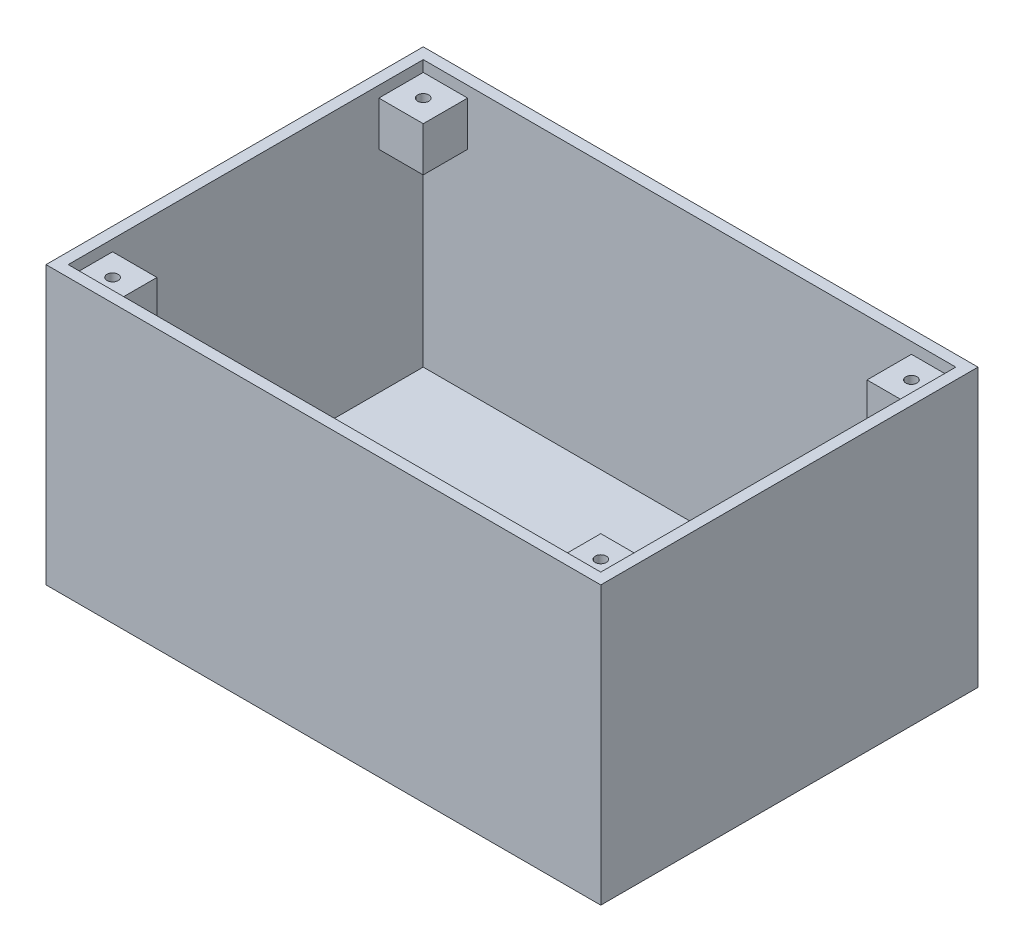
ISO-10303-21;
HEADER;
FILE_DESCRIPTION(('STEP AP214'),'2;1');
FILE_NAME('part.step','',(''),(''),'','','');
FILE_SCHEMA(('AUTOMOTIVE_DESIGN { 1 0 10303 214 1 1 1 1 }'));
ENDSEC;
DATA;
#1=APPLICATION_CONTEXT('core data for automotive mechanical design processes');
#2=APPLICATION_PROTOCOL_DEFINITION('international standard','automotive_design',2000,#1);
#3=PRODUCT_CONTEXT('',#1,'mechanical');
#4=PRODUCT('Part','Part','',(#3));
#5=PRODUCT_RELATED_PRODUCT_CATEGORY('part','',(#4));
#6=PRODUCT_DEFINITION_FORMATION('','',#4);
#7=PRODUCT_DEFINITION_CONTEXT('part definition',#1,'design');
#8=PRODUCT_DEFINITION('design','',#6,#7);
#9=PRODUCT_DEFINITION_SHAPE('','',#8);
#10=(LENGTH_UNIT() NAMED_UNIT(*) SI_UNIT(.MILLI.,.METRE.));
#11=(NAMED_UNIT(*) PLANE_ANGLE_UNIT() SI_UNIT($,.RADIAN.));
#12=(NAMED_UNIT(*) SI_UNIT($,.STERADIAN.) SOLID_ANGLE_UNIT());
#13=UNCERTAINTY_MEASURE_WITH_UNIT(LENGTH_MEASURE(1.E-05),#10,'distance_accuracy_value','');
#14=(GEOMETRIC_REPRESENTATION_CONTEXT(3) GLOBAL_UNCERTAINTY_ASSIGNED_CONTEXT((#13)) GLOBAL_UNIT_ASSIGNED_CONTEXT((#10,
#11,#12)) REPRESENTATION_CONTEXT('',''));
#15=CARTESIAN_POINT('',(0.,0.,0.));
#16=DIRECTION('',(0.,0.,1.));
#17=DIRECTION('',(1.,0.,0.));
#18=AXIS2_PLACEMENT_3D('',#15,#16,#17);
#19=CARTESIAN_POINT('',(-152.4,152.4,76.2));
#20=DIRECTION('',(1.,0.,0.));
#21=DIRECTION('',(0.,0.,-1.));
#22=AXIS2_PLACEMENT_3D('',#19,#20,#21);
#23=PLANE('',#22);
#24=DIRECTION('',(0.,1.,0.));
#25=VECTOR('',#24,1.);
#26=CARTESIAN_POINT('',(-152.4,152.4,101.6));
#27=LINE('',#26,#25);
#28=CARTESIAN_POINT('',(-152.4,127.,101.6));
#29=VERTEX_POINT('',#28);
#30=CARTESIAN_POINT('',(-152.4,152.4,101.6));
#31=VERTEX_POINT('',#30);
#32=EDGE_CURVE('E111',#29,#31,#27,.T.);
#33=ORIENTED_EDGE('',*,*,#32,.T.);
#34=DIRECTION('',(0.,0.,1.));
#35=VECTOR('',#34,1.);
#36=CARTESIAN_POINT('',(-152.4,152.4,76.2));
#37=LINE('',#36,#35);
#38=CARTESIAN_POINT('',(-152.4,152.4,76.2));
#39=VERTEX_POINT('',#38);
#40=EDGE_CURVE('E12',#39,#31,#37,.T.);
#41=ORIENTED_EDGE('',*,*,#40,.F.);
#42=DIRECTION('',(0.,1.,0.));
#43=VECTOR('',#42,1.);
#44=CARTESIAN_POINT('',(-152.4,152.4,76.2));
#45=LINE('',#44,#43);
#46=CARTESIAN_POINT('',(-152.4,127.,76.2));
#47=VERTEX_POINT('',#46);
#48=EDGE_CURVE('E99',#47,#39,#45,.T.);
#49=ORIENTED_EDGE('',*,*,#48,.F.);
#50=DIRECTION('',(0.,0.,1.));
#51=VECTOR('',#50,1.);
#52=CARTESIAN_POINT('',(-152.4,127.,76.2));
#53=LINE('',#52,#51);
#54=EDGE_CURVE('E107',#47,#29,#53,.T.);
#55=ORIENTED_EDGE('',*,*,#54,.T.);
#56=EDGE_LOOP('',(#33,#41,#49,#55));
#57=FACE_BOUND('',#56,.T.);
#58=ADVANCED_FACE('F48',(#57),#23,.F.);
#59=CARTESIAN_POINT('',(-152.4,152.4,76.2));
#60=DIRECTION('',(0.,-1.,0.));
#61=DIRECTION('',(0.,0.,-1.));
#62=AXIS2_PLACEMENT_3D('',#59,#60,#61);
#63=PLANE('',#62);
#64=CARTESIAN_POINT('',(-139.7,152.4,88.9));
#65=DIRECTION('',(0.,1.,0.));
#66=DIRECTION('',(0.,0.,-1.));
#67=AXIS2_PLACEMENT_3D('',#64,#65,#66);
#68=CIRCLE('',#67,3.175);
#69=CARTESIAN_POINT('',(-139.7,152.4,85.725));
#70=VERTEX_POINT('',#69);
#71=EDGE_CURVE('E125',#70,#70,#68,.T.);
#72=ORIENTED_EDGE('',*,*,#71,.F.);
#73=EDGE_LOOP('',(#72));
#74=FACE_BOUND('',#73,.T.);
#75=DIRECTION('',(1.,0.,0.));
#76=VECTOR('',#75,1.);
#77=CARTESIAN_POINT('',(-152.4,152.4,101.6));
#78=LINE('',#77,#76);
#79=CARTESIAN_POINT('',(-127.,152.4,101.6));
#80=VERTEX_POINT('',#79);
#81=EDGE_CURVE('E103',#31,#80,#78,.T.);
#82=ORIENTED_EDGE('',*,*,#81,.T.);
#83=DIRECTION('',(0.,0.,1.));
#84=VECTOR('',#83,1.);
#85=CARTESIAN_POINT('',(-127.,152.4,76.2));
#86=LINE('',#85,#84);
#87=CARTESIAN_POINT('',(-127.,152.4,76.2));
#88=VERTEX_POINT('',#87);
#89=EDGE_CURVE('E56',#88,#80,#86,.T.);
#90=ORIENTED_EDGE('',*,*,#89,.F.);
#91=DIRECTION('',(1.,0.,0.));
#92=VECTOR('',#91,1.);
#93=CARTESIAN_POINT('',(-152.4,152.4,76.2));
#94=LINE('',#93,#92);
#95=EDGE_CURVE('E94',#39,#88,#94,.T.);
#96=ORIENTED_EDGE('',*,*,#95,.F.);
#97=ORIENTED_EDGE('',*,*,#40,.T.);
#98=EDGE_LOOP('',(#82,#90,#96,#97));
#99=FACE_BOUND('',#98,.T.);
#100=ADVANCED_FACE('F102',(#74,#99),#63,.F.);
#101=CARTESIAN_POINT('',(-127.,152.4,76.2));
#102=DIRECTION('',(-1.,0.,0.));
#103=DIRECTION('',(0.,0.,1.));
#104=AXIS2_PLACEMENT_3D('',#101,#102,#103);
#105=PLANE('',#104);
#106=DIRECTION('',(0.,-1.,0.));
#107=VECTOR('',#106,1.);
#108=CARTESIAN_POINT('',(-127.,152.4,101.6));
#109=LINE('',#108,#107);
#110=CARTESIAN_POINT('',(-127.,127.,101.6));
#111=VERTEX_POINT('',#110);
#112=EDGE_CURVE('E81',#80,#111,#109,.T.);
#113=ORIENTED_EDGE('',*,*,#112,.T.);
#114=DIRECTION('',(0.,0.,1.));
#115=VECTOR('',#114,1.);
#116=CARTESIAN_POINT('',(-127.,127.,76.2));
#117=LINE('',#116,#115);
#118=CARTESIAN_POINT('',(-127.,127.,76.2));
#119=VERTEX_POINT('',#118);
#120=EDGE_CURVE('E104',#119,#111,#117,.T.);
#121=ORIENTED_EDGE('',*,*,#120,.F.);
#122=DIRECTION('',(0.,-1.,0.));
#123=VECTOR('',#122,1.);
#124=CARTESIAN_POINT('',(-127.,152.4,76.2));
#125=LINE('',#124,#123);
#126=EDGE_CURVE('E97',#88,#119,#125,.T.);
#127=ORIENTED_EDGE('',*,*,#126,.F.);
#128=ORIENTED_EDGE('',*,*,#89,.T.);
#129=EDGE_LOOP('',(#113,#121,#127,#128));
#130=FACE_BOUND('',#129,.T.);
#131=ADVANCED_FACE('F105',(#130),#105,.F.);
#132=CARTESIAN_POINT('',(-152.4,127.,76.2));
#133=DIRECTION('',(0.,1.,0.));
#134=DIRECTION('',(0.,0.,1.));
#135=AXIS2_PLACEMENT_3D('',#132,#133,#134);
#136=PLANE('',#135);
#137=DIRECTION('',(-1.,0.,0.));
#138=VECTOR('',#137,1.);
#139=CARTESIAN_POINT('',(-152.4,127.,101.6));
#140=LINE('',#139,#138);
#141=EDGE_CURVE('E87',#111,#29,#140,.T.);
#142=ORIENTED_EDGE('',*,*,#141,.T.);
#143=ORIENTED_EDGE('',*,*,#54,.F.);
#144=DIRECTION('',(-1.,0.,0.));
#145=VECTOR('',#144,1.);
#146=CARTESIAN_POINT('',(-152.4,127.,76.2));
#147=LINE('',#146,#145);
#148=EDGE_CURVE('E64',#119,#47,#147,.T.);
#149=ORIENTED_EDGE('',*,*,#148,.F.);
#150=ORIENTED_EDGE('',*,*,#120,.T.);
#151=EDGE_LOOP('',(#142,#143,#149,#150));
#152=FACE_BOUND('',#151,.T.);
#153=ADVANCED_FACE('F119',(#152),#136,.F.);
#154=CARTESIAN_POINT('',(0.,0.,76.2));
#155=DIRECTION('',(0.,0.,1.));
#156=DIRECTION('',(1.,0.,0.));
#157=AXIS2_PLACEMENT_3D('',#154,#155,#156);
#158=PLANE('',#157);
#159=ORIENTED_EDGE('',*,*,#48,.T.);
#160=ORIENTED_EDGE('',*,*,#95,.T.);
#161=ORIENTED_EDGE('',*,*,#126,.T.);
#162=ORIENTED_EDGE('',*,*,#148,.T.);
#163=EDGE_LOOP('',(#159,#160,#161,#162));
#164=FACE_BOUND('',#163,.T.);
#165=ADVANCED_FACE('F95',(#164),#158,.F.);
#166=CARTESIAN_POINT('',(0.,0.,101.6));
#167=DIRECTION('',(0.,0.,1.));
#168=DIRECTION('',(1.,0.,0.));
#169=AXIS2_PLACEMENT_3D('',#166,#167,#168);
#170=PLANE('',#169);
#171=ORIENTED_EDGE('',*,*,#32,.F.);
#172=ORIENTED_EDGE('',*,*,#141,.F.);
#173=ORIENTED_EDGE('',*,*,#112,.F.);
#174=ORIENTED_EDGE('',*,*,#81,.F.);
#175=EDGE_LOOP('',(#171,#172,#173,#174));
#176=FACE_BOUND('',#175,.T.);
#177=ADVANCED_FACE('F122',(#176),#170,.T.);
#178=CARTESIAN_POINT('',(-139.7,137.16,88.9));
#179=DIRECTION('',(0.,1.,0.));
#180=DIRECTION('',(0.,0.,1.));
#181=AXIS2_PLACEMENT_3D('',#178,#179,#180);
#182=CYLINDRICAL_SURFACE('',#181,3.175);
#183=CARTESIAN_POINT('',(-139.7,137.16,88.9));
#184=DIRECTION('',(0.,1.,0.));
#185=DIRECTION('',(0.,0.,-1.));
#186=AXIS2_PLACEMENT_3D('',#183,#184,#185);
#187=CIRCLE('',#186,3.175);
#188=CARTESIAN_POINT('',(-139.7,137.16,85.725));
#189=VERTEX_POINT('',#188);
#190=EDGE_CURVE('E114',#189,#189,#187,.T.);
#191=ORIENTED_EDGE('',*,*,#190,.F.);
#192=EDGE_LOOP('',(#191));
#193=FACE_BOUND('',#192,.T.);
#194=ORIENTED_EDGE('',*,*,#71,.T.);
#195=EDGE_LOOP('',(#194));
#196=FACE_BOUND('',#195,.T.);
#197=ADVANCED_FACE('F133',(#193,#196),#182,.F.);
#198=CARTESIAN_POINT('',(-139.7,137.16,88.9));
#199=DIRECTION('',(0.,-1.,0.));
#200=DIRECTION('',(0.,0.,-1.));
#201=AXIS2_PLACEMENT_3D('',#198,#199,#200);
#202=PLANE('',#201);
#203=ORIENTED_EDGE('',*,*,#190,.T.);
#204=EDGE_LOOP('',(#203));
#205=FACE_BOUND('',#204,.T.);
#206=ADVANCED_FACE('F131',(#205),#202,.F.);
#207=CLOSED_SHELL('',(#58,#100,#131,#153,#165,#177,#197,#206));
#208=MANIFOLD_SOLID_BREP('B2',#207);
#209=CARTESIAN_POINT('',(152.4,152.4,76.2));
#210=DIRECTION('',(-1.,0.,0.));
#211=DIRECTION('',(0.,0.,1.));
#212=AXIS2_PLACEMENT_3D('',#209,#210,#211);
#213=PLANE('',#212);
#214=DIRECTION('',(0.,-1.,0.));
#215=VECTOR('',#214,1.);
#216=CARTESIAN_POINT('',(152.4,152.4,101.6));
#217=LINE('',#216,#215);
#218=CARTESIAN_POINT('',(152.4,152.4,101.6));
#219=VERTEX_POINT('',#218);
#220=CARTESIAN_POINT('',(152.4,127.,101.6));
#221=VERTEX_POINT('',#220);
#222=EDGE_CURVE('E275',#219,#221,#217,.T.);
#223=ORIENTED_EDGE('',*,*,#222,.T.);
#224=DIRECTION('',(0.,0.,1.));
#225=VECTOR('',#224,1.);
#226=CARTESIAN_POINT('',(152.4,127.,76.2));
#227=LINE('',#226,#225);
#228=CARTESIAN_POINT('',(152.4,127.,76.2));
#229=VERTEX_POINT('',#228);
#230=EDGE_CURVE('E46',#229,#221,#227,.T.);
#231=ORIENTED_EDGE('',*,*,#230,.F.);
#232=DIRECTION('',(0.,-1.,0.));
#233=VECTOR('',#232,1.);
#234=CARTESIAN_POINT('',(152.4,152.4,76.2));
#235=LINE('',#234,#233);
#236=CARTESIAN_POINT('',(152.4,152.4,76.2));
#237=VERTEX_POINT('',#236);
#238=EDGE_CURVE('E263',#237,#229,#235,.T.);
#239=ORIENTED_EDGE('',*,*,#238,.F.);
#240=DIRECTION('',(0.,0.,1.));
#241=VECTOR('',#240,1.);
#242=CARTESIAN_POINT('',(152.4,152.4,76.2));
#243=LINE('',#242,#241);
#244=EDGE_CURVE('E271',#237,#219,#243,.T.);
#245=ORIENTED_EDGE('',*,*,#244,.T.);
#246=EDGE_LOOP('',(#223,#231,#239,#245));
#247=FACE_BOUND('',#246,.T.);
#248=ADVANCED_FACE('F212',(#247),#213,.F.);
#249=CARTESIAN_POINT('',(152.4,127.,76.2));
#250=DIRECTION('',(0.,1.,0.));
#251=DIRECTION('',(0.,0.,1.));
#252=AXIS2_PLACEMENT_3D('',#249,#250,#251);
#253=PLANE('',#252);
#254=DIRECTION('',(-1.,0.,0.));
#255=VECTOR('',#254,1.);
#256=CARTESIAN_POINT('',(152.4,127.,101.6));
#257=LINE('',#256,#255);
#258=CARTESIAN_POINT('',(127.,127.,101.6));
#259=VERTEX_POINT('',#258);
#260=EDGE_CURVE('E267',#221,#259,#257,.T.);
#261=ORIENTED_EDGE('',*,*,#260,.T.);
#262=DIRECTION('',(0.,0.,1.));
#263=VECTOR('',#262,1.);
#264=CARTESIAN_POINT('',(127.,127.,76.2));
#265=LINE('',#264,#263);
#266=CARTESIAN_POINT('',(127.,127.,76.2));
#267=VERTEX_POINT('',#266);
#268=EDGE_CURVE('E220',#267,#259,#265,.T.);
#269=ORIENTED_EDGE('',*,*,#268,.F.);
#270=DIRECTION('',(-1.,0.,0.));
#271=VECTOR('',#270,1.);
#272=CARTESIAN_POINT('',(152.4,127.,76.2));
#273=LINE('',#272,#271);
#274=EDGE_CURVE('E258',#229,#267,#273,.T.);
#275=ORIENTED_EDGE('',*,*,#274,.F.);
#276=ORIENTED_EDGE('',*,*,#230,.T.);
#277=EDGE_LOOP('',(#261,#269,#275,#276));
#278=FACE_BOUND('',#277,.T.);
#279=ADVANCED_FACE('F266',(#278),#253,.F.);
#280=CARTESIAN_POINT('',(127.,152.4,76.2));
#281=DIRECTION('',(1.,0.,0.));
#282=DIRECTION('',(0.,0.,-1.));
#283=AXIS2_PLACEMENT_3D('',#280,#281,#282);
#284=PLANE('',#283);
#285=DIRECTION('',(0.,1.,0.));
#286=VECTOR('',#285,1.);
#287=CARTESIAN_POINT('',(127.,152.4,101.6));
#288=LINE('',#287,#286);
#289=CARTESIAN_POINT('',(127.,152.4,101.6));
#290=VERTEX_POINT('',#289);
#291=EDGE_CURVE('E245',#259,#290,#288,.T.);
#292=ORIENTED_EDGE('',*,*,#291,.T.);
#293=DIRECTION('',(0.,0.,1.));
#294=VECTOR('',#293,1.);
#295=CARTESIAN_POINT('',(127.,152.4,76.2));
#296=LINE('',#295,#294);
#297=CARTESIAN_POINT('',(127.,152.4,76.2));
#298=VERTEX_POINT('',#297);
#299=EDGE_CURVE('E268',#298,#290,#296,.T.);
#300=ORIENTED_EDGE('',*,*,#299,.F.);
#301=DIRECTION('',(0.,1.,0.));
#302=VECTOR('',#301,1.);
#303=CARTESIAN_POINT('',(127.,152.4,76.2));
#304=LINE('',#303,#302);
#305=EDGE_CURVE('E261',#267,#298,#304,.T.);
#306=ORIENTED_EDGE('',*,*,#305,.F.);
#307=ORIENTED_EDGE('',*,*,#268,.T.);
#308=EDGE_LOOP('',(#292,#300,#306,#307));
#309=FACE_BOUND('',#308,.T.);
#310=ADVANCED_FACE('F269',(#309),#284,.F.);
#311=CARTESIAN_POINT('',(152.4,152.4,76.2));
#312=DIRECTION('',(0.,-1.,0.));
#313=DIRECTION('',(0.,0.,-1.));
#314=AXIS2_PLACEMENT_3D('',#311,#312,#313);
#315=PLANE('',#314);
#316=CARTESIAN_POINT('',(139.7,152.4,88.9));
#317=DIRECTION('',(0.,1.,0.));
#318=DIRECTION('',(0.,0.,1.));
#319=AXIS2_PLACEMENT_3D('',#316,#317,#318);
#320=CIRCLE('',#319,3.175);
#321=CARTESIAN_POINT('',(139.7,152.4,92.075));
#322=VERTEX_POINT('',#321);
#323=EDGE_CURVE('E289',#322,#322,#320,.T.);
#324=ORIENTED_EDGE('',*,*,#323,.F.);
#325=EDGE_LOOP('',(#324));
#326=FACE_BOUND('',#325,.T.);
#327=DIRECTION('',(1.,0.,0.));
#328=VECTOR('',#327,1.);
#329=CARTESIAN_POINT('',(152.4,152.4,101.6));
#330=LINE('',#329,#328);
#331=EDGE_CURVE('E251',#290,#219,#330,.T.);
#332=ORIENTED_EDGE('',*,*,#331,.T.);
#333=ORIENTED_EDGE('',*,*,#244,.F.);
#334=DIRECTION('',(1.,0.,0.));
#335=VECTOR('',#334,1.);
#336=CARTESIAN_POINT('',(152.4,152.4,76.2));
#337=LINE('',#336,#335);
#338=EDGE_CURVE('E228',#298,#237,#337,.T.);
#339=ORIENTED_EDGE('',*,*,#338,.F.);
#340=ORIENTED_EDGE('',*,*,#299,.T.);
#341=EDGE_LOOP('',(#332,#333,#339,#340));
#342=FACE_BOUND('',#341,.T.);
#343=ADVANCED_FACE('F283',(#326,#342),#315,.F.);
#344=CARTESIAN_POINT('',(0.,0.,76.2));
#345=DIRECTION('',(0.,0.,-1.));
#346=DIRECTION('',(-1.,0.,0.));
#347=AXIS2_PLACEMENT_3D('',#344,#345,#346);
#348=PLANE('',#347);
#349=ORIENTED_EDGE('',*,*,#238,.T.);
#350=ORIENTED_EDGE('',*,*,#274,.T.);
#351=ORIENTED_EDGE('',*,*,#305,.T.);
#352=ORIENTED_EDGE('',*,*,#338,.T.);
#353=EDGE_LOOP('',(#349,#350,#351,#352));
#354=FACE_BOUND('',#353,.T.);
#355=ADVANCED_FACE('F259',(#354),#348,.T.);
#356=CARTESIAN_POINT('',(0.,0.,101.6));
#357=DIRECTION('',(0.,0.,-1.));
#358=DIRECTION('',(-1.,0.,0.));
#359=AXIS2_PLACEMENT_3D('',#356,#357,#358);
#360=PLANE('',#359);
#361=ORIENTED_EDGE('',*,*,#222,.F.);
#362=ORIENTED_EDGE('',*,*,#331,.F.);
#363=ORIENTED_EDGE('',*,*,#291,.F.);
#364=ORIENTED_EDGE('',*,*,#260,.F.);
#365=EDGE_LOOP('',(#361,#362,#363,#364));
#366=FACE_BOUND('',#365,.T.);
#367=ADVANCED_FACE('F286',(#366),#360,.F.);
#368=CARTESIAN_POINT('',(139.7,137.16,88.9));
#369=DIRECTION('',(0.,1.,0.));
#370=DIRECTION('',(0.,0.,1.));
#371=AXIS2_PLACEMENT_3D('',#368,#369,#370);
#372=CYLINDRICAL_SURFACE('',#371,3.175);
#373=CARTESIAN_POINT('',(139.7,137.16,88.9));
#374=DIRECTION('',(0.,1.,0.));
#375=DIRECTION('',(0.,0.,1.));
#376=AXIS2_PLACEMENT_3D('',#373,#374,#375);
#377=CIRCLE('',#376,3.175);
#378=CARTESIAN_POINT('',(139.7,137.16,92.075));
#379=VERTEX_POINT('',#378);
#380=EDGE_CURVE('E278',#379,#379,#377,.T.);
#381=ORIENTED_EDGE('',*,*,#380,.F.);
#382=EDGE_LOOP('',(#381));
#383=FACE_BOUND('',#382,.T.);
#384=ORIENTED_EDGE('',*,*,#323,.T.);
#385=EDGE_LOOP('',(#384));
#386=FACE_BOUND('',#385,.T.);
#387=ADVANCED_FACE('F297',(#383,#386),#372,.F.);
#388=CARTESIAN_POINT('',(139.7,137.16,88.9));
#389=DIRECTION('',(0.,1.,0.));
#390=DIRECTION('',(0.,0.,1.));
#391=AXIS2_PLACEMENT_3D('',#388,#389,#390);
#392=PLANE('',#391);
#393=ORIENTED_EDGE('',*,*,#380,.T.);
#394=EDGE_LOOP('',(#393));
#395=FACE_BOUND('',#394,.T.);
#396=ADVANCED_FACE('F295',(#395),#392,.T.);
#397=CLOSED_SHELL('',(#248,#279,#310,#343,#355,#367,#387,#396));
#398=MANIFOLD_SOLID_BREP('B6',#397);
#399=CARTESIAN_POINT('',(152.4,152.4,-76.2));
#400=DIRECTION('',(-1.,0.,0.));
#401=DIRECTION('',(0.,0.,1.));
#402=AXIS2_PLACEMENT_3D('',#399,#400,#401);
#403=PLANE('',#402);
#404=DIRECTION('',(0.,1.,0.));
#405=VECTOR('',#404,1.);
#406=CARTESIAN_POINT('',(152.4,152.4,-101.6));
#407=LINE('',#406,#405);
#408=CARTESIAN_POINT('',(152.4,127.,-101.6));
#409=VERTEX_POINT('',#408);
#410=CARTESIAN_POINT('',(152.4,152.4,-101.6));
#411=VERTEX_POINT('',#410);
#412=EDGE_CURVE('E439',#409,#411,#407,.T.);
#413=ORIENTED_EDGE('',*,*,#412,.T.);
#414=DIRECTION('',(0.,0.,-1.));
#415=VECTOR('',#414,1.);
#416=CARTESIAN_POINT('',(152.4,152.4,-76.2));
#417=LINE('',#416,#415);
#418=CARTESIAN_POINT('',(152.4,152.4,-76.2));
#419=VERTEX_POINT('',#418);
#420=EDGE_CURVE('E210',#419,#411,#417,.T.);
#421=ORIENTED_EDGE('',*,*,#420,.F.);
#422=DIRECTION('',(0.,1.,0.));
#423=VECTOR('',#422,1.);
#424=CARTESIAN_POINT('',(152.4,152.4,-76.2));
#425=LINE('',#424,#423);
#426=CARTESIAN_POINT('',(152.4,127.,-76.2));
#427=VERTEX_POINT('',#426);
#428=EDGE_CURVE('E427',#427,#419,#425,.T.);
#429=ORIENTED_EDGE('',*,*,#428,.F.);
#430=DIRECTION('',(0.,0.,-1.));
#431=VECTOR('',#430,1.);
#432=CARTESIAN_POINT('',(152.4,127.,-76.2));
#433=LINE('',#432,#431);
#434=EDGE_CURVE('E435',#427,#409,#433,.T.);
#435=ORIENTED_EDGE('',*,*,#434,.T.);
#436=EDGE_LOOP('',(#413,#421,#429,#435));
#437=FACE_BOUND('',#436,.T.);
#438=ADVANCED_FACE('F376',(#437),#403,.F.);
#439=CARTESIAN_POINT('',(152.4,152.4,-76.2));
#440=DIRECTION('',(0.,-1.,0.));
#441=DIRECTION('',(0.,0.,-1.));
#442=AXIS2_PLACEMENT_3D('',#439,#440,#441);
#443=PLANE('',#442);
#444=CARTESIAN_POINT('',(139.7,152.4,-88.9));
#445=DIRECTION('',(0.,1.,0.));
#446=DIRECTION('',(0.,0.,-1.));
#447=AXIS2_PLACEMENT_3D('',#444,#445,#446);
#448=CIRCLE('',#447,3.175);
#449=CARTESIAN_POINT('',(139.7,152.4,-92.075));
#450=VERTEX_POINT('',#449);
#451=EDGE_CURVE('E453',#450,#450,#448,.T.);
#452=ORIENTED_EDGE('',*,*,#451,.F.);
#453=EDGE_LOOP('',(#452));
#454=FACE_BOUND('',#453,.T.);
#455=DIRECTION('',(-1.,0.,0.));
#456=VECTOR('',#455,1.);
#457=CARTESIAN_POINT('',(152.4,152.4,-101.6));
#458=LINE('',#457,#456);
#459=CARTESIAN_POINT('',(127.,152.4,-101.6));
#460=VERTEX_POINT('',#459);
#461=EDGE_CURVE('E431',#411,#460,#458,.T.);
#462=ORIENTED_EDGE('',*,*,#461,.T.);
#463=DIRECTION('',(0.,0.,-1.));
#464=VECTOR('',#463,1.);
#465=CARTESIAN_POINT('',(127.,152.4,-76.2));
#466=LINE('',#465,#464);
#467=CARTESIAN_POINT('',(127.,152.4,-76.2));
#468=VERTEX_POINT('',#467);
#469=EDGE_CURVE('E384',#468,#460,#466,.T.);
#470=ORIENTED_EDGE('',*,*,#469,.F.);
#471=DIRECTION('',(-1.,0.,0.));
#472=VECTOR('',#471,1.);
#473=CARTESIAN_POINT('',(152.4,152.4,-76.2));
#474=LINE('',#473,#472);
#475=EDGE_CURVE('E422',#419,#468,#474,.T.);
#476=ORIENTED_EDGE('',*,*,#475,.F.);
#477=ORIENTED_EDGE('',*,*,#420,.T.);
#478=EDGE_LOOP('',(#462,#470,#476,#477));
#479=FACE_BOUND('',#478,.T.);
#480=ADVANCED_FACE('F430',(#454,#479),#443,.F.);
#481=CARTESIAN_POINT('',(127.,152.4,-76.2));
#482=DIRECTION('',(1.,0.,0.));
#483=DIRECTION('',(0.,0.,-1.));
#484=AXIS2_PLACEMENT_3D('',#481,#482,#483);
#485=PLANE('',#484);
#486=DIRECTION('',(0.,-1.,0.));
#487=VECTOR('',#486,1.);
#488=CARTESIAN_POINT('',(127.,152.4,-101.6));
#489=LINE('',#488,#487);
#490=CARTESIAN_POINT('',(127.,127.,-101.6));
#491=VERTEX_POINT('',#490);
#492=EDGE_CURVE('E409',#460,#491,#489,.T.);
#493=ORIENTED_EDGE('',*,*,#492,.T.);
#494=DIRECTION('',(0.,0.,-1.));
#495=VECTOR('',#494,1.);
#496=CARTESIAN_POINT('',(127.,127.,-76.2));
#497=LINE('',#496,#495);
#498=CARTESIAN_POINT('',(127.,127.,-76.2));
#499=VERTEX_POINT('',#498);
#500=EDGE_CURVE('E432',#499,#491,#497,.T.);
#501=ORIENTED_EDGE('',*,*,#500,.F.);
#502=DIRECTION('',(0.,-1.,0.));
#503=VECTOR('',#502,1.);
#504=CARTESIAN_POINT('',(127.,152.4,-76.2));
#505=LINE('',#504,#503);
#506=EDGE_CURVE('E425',#468,#499,#505,.T.);
#507=ORIENTED_EDGE('',*,*,#506,.F.);
#508=ORIENTED_EDGE('',*,*,#469,.T.);
#509=EDGE_LOOP('',(#493,#501,#507,#508));
#510=FACE_BOUND('',#509,.T.);
#511=ADVANCED_FACE('F433',(#510),#485,.F.);
#512=CARTESIAN_POINT('',(152.4,127.,-76.2));
#513=DIRECTION('',(0.,1.,0.));
#514=DIRECTION('',(-1.,0.,0.));
#515=AXIS2_PLACEMENT_3D('',#512,#513,#514);
#516=PLANE('',#515);
#517=DIRECTION('',(1.,0.,0.));
#518=VECTOR('',#517,1.);
#519=CARTESIAN_POINT('',(152.4,127.,-101.6));
#520=LINE('',#519,#518);
#521=EDGE_CURVE('E415',#491,#409,#520,.T.);
#522=ORIENTED_EDGE('',*,*,#521,.T.);
#523=ORIENTED_EDGE('',*,*,#434,.F.);
#524=DIRECTION('',(1.,0.,0.));
#525=VECTOR('',#524,1.);
#526=CARTESIAN_POINT('',(152.4,127.,-76.2));
#527=LINE('',#526,#525);
#528=EDGE_CURVE('E392',#499,#427,#527,.T.);
#529=ORIENTED_EDGE('',*,*,#528,.F.);
#530=ORIENTED_EDGE('',*,*,#500,.T.);
#531=EDGE_LOOP('',(#522,#523,#529,#530));
#532=FACE_BOUND('',#531,.T.);
#533=ADVANCED_FACE('F447',(#532),#516,.F.);
#534=CARTESIAN_POINT('',(0.,0.,-76.2));
#535=DIRECTION('',(0.,0.,-1.));
#536=DIRECTION('',(-1.,0.,0.));
#537=AXIS2_PLACEMENT_3D('',#534,#535,#536);
#538=PLANE('',#537);
#539=ORIENTED_EDGE('',*,*,#428,.T.);
#540=ORIENTED_EDGE('',*,*,#475,.T.);
#541=ORIENTED_EDGE('',*,*,#506,.T.);
#542=ORIENTED_EDGE('',*,*,#528,.T.);
#543=EDGE_LOOP('',(#539,#540,#541,#542));
#544=FACE_BOUND('',#543,.T.);
#545=ADVANCED_FACE('F423',(#544),#538,.F.);
#546=CARTESIAN_POINT('',(0.,0.,-101.6));
#547=DIRECTION('',(0.,0.,-1.));
#548=DIRECTION('',(-1.,0.,0.));
#549=AXIS2_PLACEMENT_3D('',#546,#547,#548);
#550=PLANE('',#549);
#551=ORIENTED_EDGE('',*,*,#412,.F.);
#552=ORIENTED_EDGE('',*,*,#521,.F.);
#553=ORIENTED_EDGE('',*,*,#492,.F.);
#554=ORIENTED_EDGE('',*,*,#461,.F.);
#555=EDGE_LOOP('',(#551,#552,#553,#554));
#556=FACE_BOUND('',#555,.T.);
#557=ADVANCED_FACE('F450',(#556),#550,.T.);
#558=CARTESIAN_POINT('',(139.7,137.16,-88.9));
#559=DIRECTION('',(0.,1.,0.));
#560=DIRECTION('',(0.,0.,1.));
#561=AXIS2_PLACEMENT_3D('',#558,#559,#560);
#562=CYLINDRICAL_SURFACE('',#561,3.175);
#563=CARTESIAN_POINT('',(139.7,137.16,-88.9));
#564=DIRECTION('',(0.,1.,0.));
#565=DIRECTION('',(0.,0.,-1.));
#566=AXIS2_PLACEMENT_3D('',#563,#564,#565);
#567=CIRCLE('',#566,3.175);
#568=CARTESIAN_POINT('',(139.7,137.16,-92.075));
#569=VERTEX_POINT('',#568);
#570=EDGE_CURVE('E442',#569,#569,#567,.T.);
#571=ORIENTED_EDGE('',*,*,#570,.F.);
#572=EDGE_LOOP('',(#571));
#573=FACE_BOUND('',#572,.T.);
#574=ORIENTED_EDGE('',*,*,#451,.T.);
#575=EDGE_LOOP('',(#574));
#576=FACE_BOUND('',#575,.T.);
#577=ADVANCED_FACE('F461',(#573,#576),#562,.F.);
#578=CARTESIAN_POINT('',(139.7,137.16,-88.9));
#579=DIRECTION('',(0.,-1.,0.));
#580=DIRECTION('',(0.,0.,-1.));
#581=AXIS2_PLACEMENT_3D('',#578,#579,#580);
#582=PLANE('',#581);
#583=ORIENTED_EDGE('',*,*,#570,.T.);
#584=EDGE_LOOP('',(#583));
#585=FACE_BOUND('',#584,.T.);
#586=ADVANCED_FACE('F459',(#585),#582,.F.);
#587=CLOSED_SHELL('',(#438,#480,#511,#533,#545,#557,#577,#586));
#588=MANIFOLD_SOLID_BREP('B40',#587);
#589=CARTESIAN_POINT('',(-152.4,152.4,-76.2));
#590=DIRECTION('',(1.,0.,0.));
#591=DIRECTION('',(0.,0.,-1.));
#592=AXIS2_PLACEMENT_3D('',#589,#590,#591);
#593=PLANE('',#592);
#594=DIRECTION('',(0.,-1.,0.));
#595=VECTOR('',#594,1.);
#596=CARTESIAN_POINT('',(-152.4,152.4,-101.6));
#597=LINE('',#596,#595);
#598=CARTESIAN_POINT('',(-152.4,152.4,-101.6));
#599=VERTEX_POINT('',#598);
#600=CARTESIAN_POINT('',(-152.4,127.,-101.6));
#601=VERTEX_POINT('',#600);
#602=EDGE_CURVE('E602',#599,#601,#597,.T.);
#603=ORIENTED_EDGE('',*,*,#602,.T.);
#604=DIRECTION('',(0.,0.,-1.));
#605=VECTOR('',#604,1.);
#606=CARTESIAN_POINT('',(-152.4,127.,-76.2));
#607=LINE('',#606,#605);
#608=CARTESIAN_POINT('',(-152.4,127.,-76.2));
#609=VERTEX_POINT('',#608);
#610=EDGE_CURVE('E374',#609,#601,#607,.T.);
#611=ORIENTED_EDGE('',*,*,#610,.F.);
#612=DIRECTION('',(0.,-1.,0.));
#613=VECTOR('',#612,1.);
#614=CARTESIAN_POINT('',(-152.4,152.4,-76.2));
#615=LINE('',#614,#613);
#616=CARTESIAN_POINT('',(-152.4,152.4,-76.2));
#617=VERTEX_POINT('',#616);
#618=EDGE_CURVE('E590',#617,#609,#615,.T.);
#619=ORIENTED_EDGE('',*,*,#618,.F.);
#620=DIRECTION('',(0.,0.,-1.));
#621=VECTOR('',#620,1.);
#622=CARTESIAN_POINT('',(-152.4,152.4,-76.2));
#623=LINE('',#622,#621);
#624=EDGE_CURVE('E598',#617,#599,#623,.T.);
#625=ORIENTED_EDGE('',*,*,#624,.T.);
#626=EDGE_LOOP('',(#603,#611,#619,#625));
#627=FACE_BOUND('',#626,.T.);
#628=ADVANCED_FACE('F539',(#627),#593,.F.);
#629=CARTESIAN_POINT('',(-152.4,127.,-76.2));
#630=DIRECTION('',(0.,1.,0.));
#631=DIRECTION('',(-1.,0.,0.));
#632=AXIS2_PLACEMENT_3D('',#629,#630,#631);
#633=PLANE('',#632);
#634=DIRECTION('',(1.,0.,0.));
#635=VECTOR('',#634,1.);
#636=CARTESIAN_POINT('',(-152.4,127.,-101.6));
#637=LINE('',#636,#635);
#638=CARTESIAN_POINT('',(-127.,127.,-101.6));
#639=VERTEX_POINT('',#638);
#640=EDGE_CURVE('E594',#601,#639,#637,.T.);
#641=ORIENTED_EDGE('',*,*,#640,.T.);
#642=DIRECTION('',(0.,0.,-1.));
#643=VECTOR('',#642,1.);
#644=CARTESIAN_POINT('',(-127.,127.,-76.2));
#645=LINE('',#644,#643);
#646=CARTESIAN_POINT('',(-127.,127.,-76.2));
#647=VERTEX_POINT('',#646);
#648=EDGE_CURVE('E547',#647,#639,#645,.T.);
#649=ORIENTED_EDGE('',*,*,#648,.F.);
#650=DIRECTION('',(1.,0.,0.));
#651=VECTOR('',#650,1.);
#652=CARTESIAN_POINT('',(-152.4,127.,-76.2));
#653=LINE('',#652,#651);
#654=EDGE_CURVE('E585',#609,#647,#653,.T.);
#655=ORIENTED_EDGE('',*,*,#654,.F.);
#656=ORIENTED_EDGE('',*,*,#610,.T.);
#657=EDGE_LOOP('',(#641,#649,#655,#656));
#658=FACE_BOUND('',#657,.T.);
#659=ADVANCED_FACE('F593',(#658),#633,.F.);
#660=CARTESIAN_POINT('',(-127.,152.4,-76.2));
#661=DIRECTION('',(-1.,0.,0.));
#662=DIRECTION('',(0.,0.,1.));
#663=AXIS2_PLACEMENT_3D('',#660,#661,#662);
#664=PLANE('',#663);
#665=DIRECTION('',(0.,1.,0.));
#666=VECTOR('',#665,1.);
#667=CARTESIAN_POINT('',(-127.,152.4,-101.6));
#668=LINE('',#667,#666);
#669=CARTESIAN_POINT('',(-127.,152.4,-101.6));
#670=VERTEX_POINT('',#669);
#671=EDGE_CURVE('E572',#639,#670,#668,.T.);
#672=ORIENTED_EDGE('',*,*,#671,.T.);
#673=DIRECTION('',(0.,0.,-1.));
#674=VECTOR('',#673,1.);
#675=CARTESIAN_POINT('',(-127.,152.4,-76.2));
#676=LINE('',#675,#674);
#677=CARTESIAN_POINT('',(-127.,152.4,-76.2));
#678=VERTEX_POINT('',#677);
#679=EDGE_CURVE('E595',#678,#670,#676,.T.);
#680=ORIENTED_EDGE('',*,*,#679,.F.);
#681=DIRECTION('',(0.,1.,0.));
#682=VECTOR('',#681,1.);
#683=CARTESIAN_POINT('',(-127.,152.4,-76.2));
#684=LINE('',#683,#682);
#685=EDGE_CURVE('E588',#647,#678,#684,.T.);
#686=ORIENTED_EDGE('',*,*,#685,.F.);
#687=ORIENTED_EDGE('',*,*,#648,.T.);
#688=EDGE_LOOP('',(#672,#680,#686,#687));
#689=FACE_BOUND('',#688,.T.);
#690=ADVANCED_FACE('F596',(#689),#664,.F.);
#691=CARTESIAN_POINT('',(-152.4,152.4,-76.2));
#692=DIRECTION('',(0.,-1.,0.));
#693=DIRECTION('',(0.,0.,-1.));
#694=AXIS2_PLACEMENT_3D('',#691,#692,#693);
#695=PLANE('',#694);
#696=CARTESIAN_POINT('',(-139.7,152.4,-88.9));
#697=DIRECTION('',(0.,1.,0.));
#698=DIRECTION('',(0.,0.,1.));
#699=AXIS2_PLACEMENT_3D('',#696,#697,#698);
#700=CIRCLE('',#699,3.175);
#701=CARTESIAN_POINT('',(-139.7,152.4,-85.725));
#702=VERTEX_POINT('',#701);
#703=EDGE_CURVE('E616',#702,#702,#700,.T.);
#704=ORIENTED_EDGE('',*,*,#703,.F.);
#705=EDGE_LOOP('',(#704));
#706=FACE_BOUND('',#705,.T.);
#707=DIRECTION('',(-1.,0.,0.));
#708=VECTOR('',#707,1.);
#709=CARTESIAN_POINT('',(-152.4,152.4,-101.6));
#710=LINE('',#709,#708);
#711=EDGE_CURVE('E578',#670,#599,#710,.T.);
#712=ORIENTED_EDGE('',*,*,#711,.T.);
#713=ORIENTED_EDGE('',*,*,#624,.F.);
#714=DIRECTION('',(-1.,0.,0.));
#715=VECTOR('',#714,1.);
#716=CARTESIAN_POINT('',(-152.4,152.4,-76.2));
#717=LINE('',#716,#715);
#718=EDGE_CURVE('E555',#678,#617,#717,.T.);
#719=ORIENTED_EDGE('',*,*,#718,.F.);
#720=ORIENTED_EDGE('',*,*,#679,.T.);
#721=EDGE_LOOP('',(#712,#713,#719,#720));
#722=FACE_BOUND('',#721,.T.);
#723=ADVANCED_FACE('F610',(#706,#722),#695,.F.);
#724=CARTESIAN_POINT('',(0.,0.,-76.2));
#725=DIRECTION('',(0.,0.,1.));
#726=DIRECTION('',(1.,0.,0.));
#727=AXIS2_PLACEMENT_3D('',#724,#725,#726);
#728=PLANE('',#727);
#729=ORIENTED_EDGE('',*,*,#618,.T.);
#730=ORIENTED_EDGE('',*,*,#654,.T.);
#731=ORIENTED_EDGE('',*,*,#685,.T.);
#732=ORIENTED_EDGE('',*,*,#718,.T.);
#733=EDGE_LOOP('',(#729,#730,#731,#732));
#734=FACE_BOUND('',#733,.T.);
#735=ADVANCED_FACE('F586',(#734),#728,.T.);
#736=CARTESIAN_POINT('',(0.,0.,-101.6));
#737=DIRECTION('',(0.,0.,1.));
#738=DIRECTION('',(1.,0.,0.));
#739=AXIS2_PLACEMENT_3D('',#736,#737,#738);
#740=PLANE('',#739);
#741=ORIENTED_EDGE('',*,*,#602,.F.);
#742=ORIENTED_EDGE('',*,*,#711,.F.);
#743=ORIENTED_EDGE('',*,*,#671,.F.);
#744=ORIENTED_EDGE('',*,*,#640,.F.);
#745=EDGE_LOOP('',(#741,#742,#743,#744));
#746=FACE_BOUND('',#745,.T.);
#747=ADVANCED_FACE('F613',(#746),#740,.F.);
#748=CARTESIAN_POINT('',(-139.7,137.16,-88.9));
#749=DIRECTION('',(0.,1.,0.));
#750=DIRECTION('',(0.,0.,1.));
#751=AXIS2_PLACEMENT_3D('',#748,#749,#750);
#752=CYLINDRICAL_SURFACE('',#751,3.175);
#753=CARTESIAN_POINT('',(-139.7,137.16,-88.9));
#754=DIRECTION('',(0.,1.,0.));
#755=DIRECTION('',(0.,0.,1.));
#756=AXIS2_PLACEMENT_3D('',#753,#754,#755);
#757=CIRCLE('',#756,3.175);
#758=CARTESIAN_POINT('',(-139.7,137.16,-85.725));
#759=VERTEX_POINT('',#758);
#760=EDGE_CURVE('E605',#759,#759,#757,.T.);
#761=ORIENTED_EDGE('',*,*,#760,.F.);
#762=EDGE_LOOP('',(#761));
#763=FACE_BOUND('',#762,.T.);
#764=ORIENTED_EDGE('',*,*,#703,.T.);
#765=EDGE_LOOP('',(#764));
#766=FACE_BOUND('',#765,.T.);
#767=ADVANCED_FACE('F624',(#763,#766),#752,.F.);
#768=CARTESIAN_POINT('',(-139.7,137.16,-88.9));
#769=DIRECTION('',(0.,1.,0.));
#770=DIRECTION('',(0.,0.,1.));
#771=AXIS2_PLACEMENT_3D('',#768,#769,#770);
#772=PLANE('',#771);
#773=ORIENTED_EDGE('',*,*,#760,.T.);
#774=EDGE_LOOP('',(#773));
#775=FACE_BOUND('',#774,.T.);
#776=ADVANCED_FACE('F622',(#775),#772,.T.);
#777=CLOSED_SHELL('',(#628,#659,#690,#723,#735,#747,#767,#776));
#778=MANIFOLD_SOLID_BREP('B204',#777);
#779=CARTESIAN_POINT('',(-158.75,6.35,107.95));
#780=DIRECTION('',(1.,0.,0.));
#781=DIRECTION('',(0.,0.,-1.));
#782=AXIS2_PLACEMENT_3D('',#779,#780,#781);
#783=PLANE('',#782);
#784=DIRECTION('',(0.,0.,1.));
#785=VECTOR('',#784,1.);
#786=CARTESIAN_POINT('',(-158.75,0.,107.95));
#787=LINE('',#786,#785);
#788=CARTESIAN_POINT('',(-158.75,0.,-107.95));
#789=VERTEX_POINT('',#788);
#790=CARTESIAN_POINT('',(-158.75,0.,107.95));
#791=VERTEX_POINT('',#790);
#792=EDGE_CURVE('E803',#789,#791,#787,.T.);
#793=ORIENTED_EDGE('',*,*,#792,.T.);
#794=DIRECTION('',(0.,-1.,0.));
#795=VECTOR('',#794,1.);
#796=CARTESIAN_POINT('',(-158.75,6.35,107.95));
#797=LINE('',#796,#795);
#798=CARTESIAN_POINT('',(-158.75,158.75,107.95));
#799=VERTEX_POINT('',#798);
#800=EDGE_CURVE('E537',#799,#791,#797,.T.);
#801=ORIENTED_EDGE('',*,*,#800,.F.);
#802=DIRECTION('',(0.,0.,1.));
#803=VECTOR('',#802,1.);
#804=CARTESIAN_POINT('',(-158.75,158.75,-107.95));
#805=LINE('',#804,#803);
#806=CARTESIAN_POINT('',(-158.75,158.75,-107.95));
#807=VERTEX_POINT('',#806);
#808=EDGE_CURVE('E794',#807,#799,#805,.T.);
#809=ORIENTED_EDGE('',*,*,#808,.F.);
#810=DIRECTION('',(0.,-1.,0.));
#811=VECTOR('',#810,1.);
#812=CARTESIAN_POINT('',(-158.75,6.35,-107.95));
#813=LINE('',#812,#811);
#814=EDGE_CURVE('E812',#807,#789,#813,.T.);
#815=ORIENTED_EDGE('',*,*,#814,.T.);
#816=EDGE_LOOP('',(#793,#801,#809,#815));
#817=FACE_BOUND('',#816,.T.);
#818=ADVANCED_FACE('F692',(#817),#783,.F.);
#819=CARTESIAN_POINT('',(158.75,6.35,107.95));
#820=DIRECTION('',(0.,0.,-1.));
#821=DIRECTION('',(-1.,0.,0.));
#822=AXIS2_PLACEMENT_3D('',#819,#820,#821);
#823=PLANE('',#822);
#824=DIRECTION('',(1.,0.,0.));
#825=VECTOR('',#824,1.);
#826=CARTESIAN_POINT('',(158.75,0.,107.95));
#827=LINE('',#826,#825);
#828=CARTESIAN_POINT('',(158.75,0.,107.95));
#829=VERTEX_POINT('',#828);
#830=EDGE_CURVE('E806',#791,#829,#827,.T.);
#831=ORIENTED_EDGE('',*,*,#830,.T.);
#832=DIRECTION('',(0.,-1.,0.));
#833=VECTOR('',#832,1.);
#834=CARTESIAN_POINT('',(158.75,6.35,107.95));
#835=LINE('',#834,#833);
#836=CARTESIAN_POINT('',(158.75,158.75,107.95));
#837=VERTEX_POINT('',#836);
#838=EDGE_CURVE('E699',#837,#829,#835,.T.);
#839=ORIENTED_EDGE('',*,*,#838,.F.);
#840=DIRECTION('',(1.,0.,0.));
#841=VECTOR('',#840,1.);
#842=CARTESIAN_POINT('',(-158.75,158.75,107.95));
#843=LINE('',#842,#841);
#844=EDGE_CURVE('E797',#799,#837,#843,.T.);
#845=ORIENTED_EDGE('',*,*,#844,.F.);
#846=ORIENTED_EDGE('',*,*,#800,.T.);
#847=EDGE_LOOP('',(#831,#839,#845,#846));
#848=FACE_BOUND('',#847,.T.);
#849=ADVANCED_FACE('F834',(#848),#823,.F.);
#850=CARTESIAN_POINT('',(158.75,6.35,107.95));
#851=DIRECTION('',(-1.,0.,0.));
#852=DIRECTION('',(0.,0.,1.));
#853=AXIS2_PLACEMENT_3D('',#850,#851,#852);
#854=PLANE('',#853);
#855=DIRECTION('',(0.,0.,-1.));
#856=VECTOR('',#855,1.);
#857=CARTESIAN_POINT('',(158.75,0.,107.95));
#858=LINE('',#857,#856);
#859=CARTESIAN_POINT('',(158.75,0.,-107.95));
#860=VERTEX_POINT('',#859);
#861=EDGE_CURVE('E808',#829,#860,#858,.T.);
#862=ORIENTED_EDGE('',*,*,#861,.T.);
#863=DIRECTION('',(0.,-1.,0.));
#864=VECTOR('',#863,1.);
#865=CARTESIAN_POINT('',(158.75,6.35,-107.95));
#866=LINE('',#865,#864);
#867=CARTESIAN_POINT('',(158.75,158.75,-107.95));
#868=VERTEX_POINT('',#867);
#869=EDGE_CURVE('E815',#868,#860,#866,.T.);
#870=ORIENTED_EDGE('',*,*,#869,.F.);
#871=DIRECTION('',(0.,0.,-1.));
#872=VECTOR('',#871,1.);
#873=CARTESIAN_POINT('',(158.75,158.75,107.95));
#874=LINE('',#873,#872);
#875=EDGE_CURVE('E800',#837,#868,#874,.T.);
#876=ORIENTED_EDGE('',*,*,#875,.F.);
#877=ORIENTED_EDGE('',*,*,#838,.T.);
#878=EDGE_LOOP('',(#862,#870,#876,#877));
#879=FACE_BOUND('',#878,.T.);
#880=ADVANCED_FACE('F821',(#879),#854,.F.);
#881=CARTESIAN_POINT('',(158.75,6.35,-107.95));
#882=DIRECTION('',(0.,0.,1.));
#883=DIRECTION('',(1.,0.,0.));
#884=AXIS2_PLACEMENT_3D('',#881,#882,#883);
#885=PLANE('',#884);
#886=DIRECTION('',(-1.,0.,0.));
#887=VECTOR('',#886,1.);
#888=CARTESIAN_POINT('',(158.75,0.,-107.95));
#889=LINE('',#888,#887);
#890=EDGE_CURVE('E810',#860,#789,#889,.T.);
#891=ORIENTED_EDGE('',*,*,#890,.T.);
#892=ORIENTED_EDGE('',*,*,#814,.F.);
#893=DIRECTION('',(-1.,0.,0.));
#894=VECTOR('',#893,1.);
#895=CARTESIAN_POINT('',(158.75,158.75,-107.95));
#896=LINE('',#895,#894);
#897=EDGE_CURVE('E770',#868,#807,#896,.T.);
#898=ORIENTED_EDGE('',*,*,#897,.F.);
#899=ORIENTED_EDGE('',*,*,#869,.T.);
#900=EDGE_LOOP('',(#891,#892,#898,#899));
#901=FACE_BOUND('',#900,.T.);
#902=ADVANCED_FACE('F829',(#901),#885,.F.);
#903=CARTESIAN_POINT('',(0.,0.,0.));
#904=DIRECTION('',(0.,1.,0.));
#905=DIRECTION('',(0.,0.,1.));
#906=AXIS2_PLACEMENT_3D('',#903,#904,#905);
#907=PLANE('',#906);
#908=ORIENTED_EDGE('',*,*,#792,.F.);
#909=ORIENTED_EDGE('',*,*,#890,.F.);
#910=ORIENTED_EDGE('',*,*,#861,.F.);
#911=ORIENTED_EDGE('',*,*,#830,.F.);
#912=EDGE_LOOP('',(#908,#909,#910,#911));
#913=FACE_BOUND('',#912,.T.);
#914=ADVANCED_FACE('F827',(#913),#907,.F.);
#915=CARTESIAN_POINT('',(0.,158.75,0.));
#916=DIRECTION('',(0.,1.,0.));
#917=DIRECTION('',(0.,0.,1.));
#918=AXIS2_PLACEMENT_3D('',#915,#916,#917);
#919=PLANE('',#918);
#920=ORIENTED_EDGE('',*,*,#897,.T.);
#921=ORIENTED_EDGE('',*,*,#808,.T.);
#922=ORIENTED_EDGE('',*,*,#844,.T.);
#923=ORIENTED_EDGE('',*,*,#875,.T.);
#924=EDGE_LOOP('',(#920,#921,#922,#923));
#925=FACE_BOUND('',#924,.T.);
#926=DIRECTION('',(1.,0.,0.));
#927=VECTOR('',#926,1.);
#928=CARTESIAN_POINT('',(152.4,158.75,101.6));
#929=LINE('',#928,#927);
#930=CARTESIAN_POINT('',(-152.4,158.75,101.6));
#931=VERTEX_POINT('',#930);
#932=CARTESIAN_POINT('',(152.4,158.75,101.6));
#933=VERTEX_POINT('',#932);
#934=EDGE_CURVE('E764',#931,#933,#929,.T.);
#935=ORIENTED_EDGE('',*,*,#934,.F.);
#936=DIRECTION('',(0.,0.,1.));
#937=VECTOR('',#936,1.);
#938=CARTESIAN_POINT('',(-152.4,158.75,101.6));
#939=LINE('',#938,#937);
#940=CARTESIAN_POINT('',(-152.4,158.75,-101.6));
#941=VERTEX_POINT('',#940);
#942=EDGE_CURVE('E755',#941,#931,#939,.T.);
#943=ORIENTED_EDGE('',*,*,#942,.F.);
#944=DIRECTION('',(-1.,0.,0.));
#945=VECTOR('',#944,1.);
#946=CARTESIAN_POINT('',(152.4,158.75,-101.6));
#947=LINE('',#946,#945);
#948=CARTESIAN_POINT('',(152.4,158.75,-101.6));
#949=VERTEX_POINT('',#948);
#950=EDGE_CURVE('E778',#949,#941,#947,.T.);
#951=ORIENTED_EDGE('',*,*,#950,.F.);
#952=DIRECTION('',(0.,0.,-1.));
#953=VECTOR('',#952,1.);
#954=CARTESIAN_POINT('',(152.4,158.75,101.6));
#955=LINE('',#954,#953);
#956=EDGE_CURVE('E776',#933,#949,#955,.T.);
#957=ORIENTED_EDGE('',*,*,#956,.F.);
#958=EDGE_LOOP('',(#935,#943,#951,#957));
#959=FACE_BOUND('',#958,.T.);
#960=ADVANCED_FACE('F774',(#925,#959),#919,.T.);
#961=CARTESIAN_POINT('',(-152.4,158.75,101.6));
#962=DIRECTION('',(1.,0.,0.));
#963=DIRECTION('',(0.,0.,-1.));
#964=AXIS2_PLACEMENT_3D('',#961,#962,#963);
#965=PLANE('',#964);
#966=DIRECTION('',(0.,0.,1.));
#967=VECTOR('',#966,1.);
#968=CARTESIAN_POINT('',(-152.4,6.35,101.6));
#969=LINE('',#968,#967);
#970=CARTESIAN_POINT('',(-152.4,6.35,-101.6));
#971=VERTEX_POINT('',#970);
#972=CARTESIAN_POINT('',(-152.4,6.35,101.6));
#973=VERTEX_POINT('',#972);
#974=EDGE_CURVE('E706',#971,#973,#969,.T.);
#975=ORIENTED_EDGE('',*,*,#974,.F.);
#976=DIRECTION('',(0.,-1.,0.));
#977=VECTOR('',#976,1.);
#978=CARTESIAN_POINT('',(-152.4,158.75,-101.6));
#979=LINE('',#978,#977);
#980=EDGE_CURVE('E760',#941,#971,#979,.T.);
#981=ORIENTED_EDGE('',*,*,#980,.F.);
#982=ORIENTED_EDGE('',*,*,#942,.T.);
#983=DIRECTION('',(0.,-1.,0.));
#984=VECTOR('',#983,1.);
#985=CARTESIAN_POINT('',(-152.4,158.75,101.6));
#986=LINE('',#985,#984);
#987=EDGE_CURVE('E758',#931,#973,#986,.T.);
#988=ORIENTED_EDGE('',*,*,#987,.T.);
#989=EDGE_LOOP('',(#975,#981,#982,#988));
#990=FACE_BOUND('',#989,.T.);
#991=ADVANCED_FACE('F757',(#990),#965,.T.);
#992=CARTESIAN_POINT('',(152.4,158.75,101.6));
#993=DIRECTION('',(0.,0.,-1.));
#994=DIRECTION('',(-1.,0.,0.));
#995=AXIS2_PLACEMENT_3D('',#992,#993,#994);
#996=PLANE('',#995);
#997=DIRECTION('',(1.,0.,0.));
#998=VECTOR('',#997,1.);
#999=CARTESIAN_POINT('',(152.4,6.35,101.6));
#1000=LINE('',#999,#998);
#1001=CARTESIAN_POINT('',(152.4,6.35,101.6));
#1002=VERTEX_POINT('',#1001);
#1003=EDGE_CURVE('E710',#973,#1002,#1000,.T.);
#1004=ORIENTED_EDGE('',*,*,#1003,.F.);
#1005=ORIENTED_EDGE('',*,*,#987,.F.);
#1006=ORIENTED_EDGE('',*,*,#934,.T.);
#1007=DIRECTION('',(0.,-1.,0.));
#1008=VECTOR('',#1007,1.);
#1009=CARTESIAN_POINT('',(152.4,158.75,101.6));
#1010=LINE('',#1009,#1008);
#1011=EDGE_CURVE('E771',#933,#1002,#1010,.T.);
#1012=ORIENTED_EDGE('',*,*,#1011,.T.);
#1013=EDGE_LOOP('',(#1004,#1005,#1006,#1012));
#1014=FACE_BOUND('',#1013,.T.);
#1015=ADVANCED_FACE('F768',(#1014),#996,.T.);
#1016=CARTESIAN_POINT('',(152.4,158.75,101.6));
#1017=DIRECTION('',(-1.,0.,0.));
#1018=DIRECTION('',(0.,0.,1.));
#1019=AXIS2_PLACEMENT_3D('',#1016,#1017,#1018);
#1020=PLANE('',#1019);
#1021=DIRECTION('',(0.,0.,-1.));
#1022=VECTOR('',#1021,1.);
#1023=CARTESIAN_POINT('',(152.4,6.35,101.6));
#1024=LINE('',#1023,#1022);
#1025=CARTESIAN_POINT('',(152.4,6.35,-101.6));
#1026=VERTEX_POINT('',#1025);
#1027=EDGE_CURVE('E784',#1002,#1026,#1024,.T.);
#1028=ORIENTED_EDGE('',*,*,#1027,.F.);
#1029=ORIENTED_EDGE('',*,*,#1011,.F.);
#1030=ORIENTED_EDGE('',*,*,#956,.T.);
#1031=DIRECTION('',(0.,-1.,0.));
#1032=VECTOR('',#1031,1.);
#1033=CARTESIAN_POINT('',(152.4,158.75,-101.6));
#1034=LINE('',#1033,#1032);
#1035=EDGE_CURVE('E788',#949,#1026,#1034,.T.);
#1036=ORIENTED_EDGE('',*,*,#1035,.T.);
#1037=EDGE_LOOP('',(#1028,#1029,#1030,#1036));
#1038=FACE_BOUND('',#1037,.T.);
#1039=ADVANCED_FACE('F856',(#1038),#1020,.T.);
#1040=CARTESIAN_POINT('',(152.4,158.75,-101.6));
#1041=DIRECTION('',(0.,0.,1.));
#1042=DIRECTION('',(1.,0.,0.));
#1043=AXIS2_PLACEMENT_3D('',#1040,#1041,#1042);
#1044=PLANE('',#1043);
#1045=DIRECTION('',(-1.,0.,0.));
#1046=VECTOR('',#1045,1.);
#1047=CARTESIAN_POINT('',(152.4,6.35,-101.6));
#1048=LINE('',#1047,#1046);
#1049=EDGE_CURVE('E765',#1026,#971,#1048,.T.);
#1050=ORIENTED_EDGE('',*,*,#1049,.F.);
#1051=ORIENTED_EDGE('',*,*,#1035,.F.);
#1052=ORIENTED_EDGE('',*,*,#950,.T.);
#1053=ORIENTED_EDGE('',*,*,#980,.T.);
#1054=EDGE_LOOP('',(#1050,#1051,#1052,#1053));
#1055=FACE_BOUND('',#1054,.T.);
#1056=ADVANCED_FACE('F849',(#1055),#1044,.T.);
#1057=CARTESIAN_POINT('',(0.,6.35,0.));
#1058=DIRECTION('',(0.,1.,0.));
#1059=DIRECTION('',(0.,0.,1.));
#1060=AXIS2_PLACEMENT_3D('',#1057,#1058,#1059);
#1061=PLANE('',#1060);
#1062=ORIENTED_EDGE('',*,*,#974,.T.);
#1063=ORIENTED_EDGE('',*,*,#1003,.T.);
#1064=ORIENTED_EDGE('',*,*,#1027,.T.);
#1065=ORIENTED_EDGE('',*,*,#1049,.T.);
#1066=EDGE_LOOP('',(#1062,#1063,#1064,#1065));
#1067=FACE_BOUND('',#1066,.T.);
#1068=ADVANCED_FACE('F846',(#1067),#1061,.T.);
#1069=CLOSED_SHELL('',(#818,#849,#880,#902,#914,#960,#991,#1015,#1039,#1056,#1068));
#1070=MANIFOLD_SOLID_BREP('B368',#1069);
#1071=ADVANCED_BREP_SHAPE_REPRESENTATION('',(#18,#208,#398,#588,#778,#1070),#14);
#1072=SHAPE_DEFINITION_REPRESENTATION(#9,#1071);
ENDSEC;
END-ISO-10303-21;
